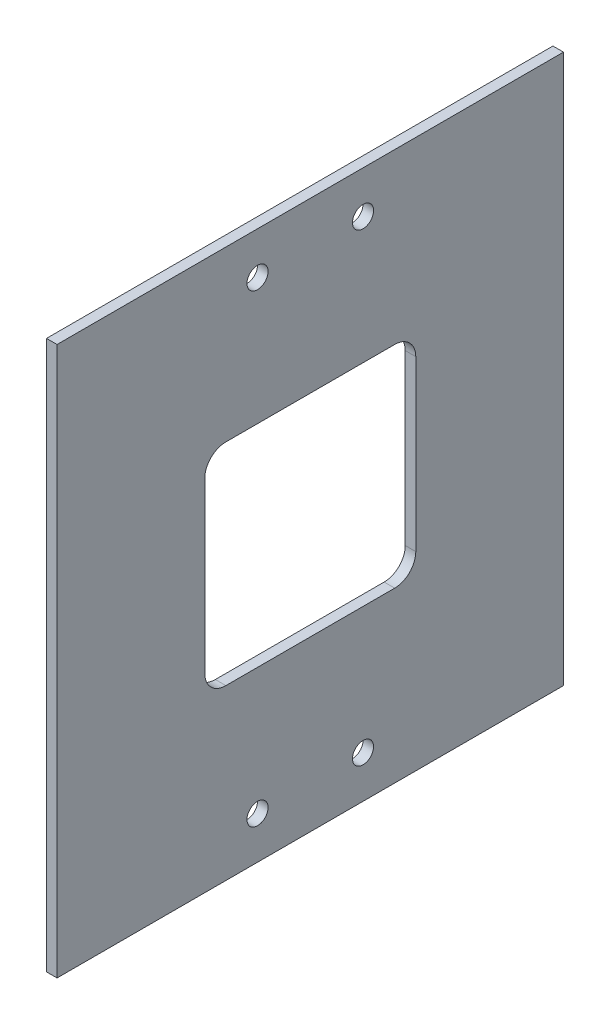
ISO-10303-21;
HEADER;
FILE_DESCRIPTION(('STEP AP214'),'2;1');
FILE_NAME('part.step','',(''),(''),'','','');
FILE_SCHEMA(('AUTOMOTIVE_DESIGN { 1 0 10303 214 1 1 1 1 }'));
ENDSEC;
DATA;
#1=APPLICATION_CONTEXT('core data for automotive mechanical design processes');
#2=APPLICATION_PROTOCOL_DEFINITION('international standard','automotive_design',2000,#1);
#3=PRODUCT_CONTEXT('',#1,'mechanical');
#4=PRODUCT('Part','Part','',(#3));
#5=PRODUCT_RELATED_PRODUCT_CATEGORY('part','',(#4));
#6=PRODUCT_DEFINITION_FORMATION('','',#4);
#7=PRODUCT_DEFINITION_CONTEXT('part definition',#1,'design');
#8=PRODUCT_DEFINITION('design','',#6,#7);
#9=PRODUCT_DEFINITION_SHAPE('','',#8);
#10=(LENGTH_UNIT() NAMED_UNIT(*) SI_UNIT(.MILLI.,.METRE.));
#11=(NAMED_UNIT(*) PLANE_ANGLE_UNIT() SI_UNIT($,.RADIAN.));
#12=(NAMED_UNIT(*) SI_UNIT($,.STERADIAN.) SOLID_ANGLE_UNIT());
#13=UNCERTAINTY_MEASURE_WITH_UNIT(LENGTH_MEASURE(1.E-05),#10,'distance_accuracy_value','');
#14=(GEOMETRIC_REPRESENTATION_CONTEXT(3) GLOBAL_UNCERTAINTY_ASSIGNED_CONTEXT((#13)) GLOBAL_UNIT_ASSIGNED_CONTEXT((#10,
#11,#12)) REPRESENTATION_CONTEXT('',''));
#15=CARTESIAN_POINT('',(0.,0.,0.));
#16=DIRECTION('',(0.,0.,1.));
#17=DIRECTION('',(1.,0.,0.));
#18=AXIS2_PLACEMENT_3D('',#15,#16,#17);
#19=CARTESIAN_POINT('',(3.175,82.55,0.));
#20=DIRECTION('',(0.,0.,-1.));
#21=DIRECTION('',(0.,1.,0.));
#22=AXIS2_PLACEMENT_3D('',#19,#20,#21);
#23=PLANE('',#22);
#24=DIRECTION('',(0.,-1.,0.));
#25=VECTOR('',#24,1.);
#26=CARTESIAN_POINT('',(0.,82.55,0.));
#27=LINE('',#26,#25);
#28=CARTESIAN_POINT('',(0.,82.55,0.));
#29=VERTEX_POINT('',#28);
#30=CARTESIAN_POINT('',(0.,-82.55,0.));
#31=VERTEX_POINT('',#30);
#32=EDGE_CURVE('E200',#29,#31,#27,.T.);
#33=ORIENTED_EDGE('',*,*,#32,.T.);
#34=DIRECTION('',(-1.,0.,0.));
#35=VECTOR('',#34,1.);
#36=CARTESIAN_POINT('',(3.175,-82.55,0.));
#37=LINE('',#36,#35);
#38=CARTESIAN_POINT('',(3.175,-82.55,0.));
#39=VERTEX_POINT('',#38);
#40=EDGE_CURVE('E11',#39,#31,#37,.T.);
#41=ORIENTED_EDGE('',*,*,#40,.F.);
#42=DIRECTION('',(0.,-1.,0.));
#43=VECTOR('',#42,1.);
#44=CARTESIAN_POINT('',(3.175,82.55,0.));
#45=LINE('',#44,#43);
#46=CARTESIAN_POINT('',(3.175,82.55,0.));
#47=VERTEX_POINT('',#46);
#48=EDGE_CURVE('E215',#47,#39,#45,.T.);
#49=ORIENTED_EDGE('',*,*,#48,.F.);
#50=DIRECTION('',(-1.,0.,0.));
#51=VECTOR('',#50,1.);
#52=CARTESIAN_POINT('',(3.175,82.55,0.));
#53=LINE('',#52,#51);
#54=EDGE_CURVE('E227',#47,#29,#53,.T.);
#55=ORIENTED_EDGE('',*,*,#54,.T.);
#56=EDGE_LOOP('',(#33,#41,#49,#55));
#57=FACE_BOUND('',#56,.T.);
#58=ADVANCED_FACE('F37',(#57),#23,.F.);
#59=CARTESIAN_POINT('',(3.175,-82.55,-152.4));
#60=DIRECTION('',(0.,1.,0.));
#61=DIRECTION('',(0.,0.,1.));
#62=AXIS2_PLACEMENT_3D('',#59,#60,#61);
#63=PLANE('',#62);
#64=DIRECTION('',(0.,0.,-1.));
#65=VECTOR('',#64,1.);
#66=CARTESIAN_POINT('',(0.,-82.55,-152.4));
#67=LINE('',#66,#65);
#68=CARTESIAN_POINT('',(0.,-82.55,-152.4));
#69=VERTEX_POINT('',#68);
#70=EDGE_CURVE('E230',#31,#69,#67,.T.);
#71=ORIENTED_EDGE('',*,*,#70,.T.);
#72=DIRECTION('',(-1.,0.,0.));
#73=VECTOR('',#72,1.);
#74=CARTESIAN_POINT('',(3.175,-82.55,-152.4));
#75=LINE('',#74,#73);
#76=CARTESIAN_POINT('',(3.175,-82.55,-152.4));
#77=VERTEX_POINT('',#76);
#78=EDGE_CURVE('E44',#77,#69,#75,.T.);
#79=ORIENTED_EDGE('',*,*,#78,.F.);
#80=DIRECTION('',(0.,0.,-1.));
#81=VECTOR('',#80,1.);
#82=CARTESIAN_POINT('',(3.175,-82.55,-152.4));
#83=LINE('',#82,#81);
#84=EDGE_CURVE('E218',#39,#77,#83,.T.);
#85=ORIENTED_EDGE('',*,*,#84,.F.);
#86=ORIENTED_EDGE('',*,*,#40,.T.);
#87=EDGE_LOOP('',(#71,#79,#85,#86));
#88=FACE_BOUND('',#87,.T.);
#89=ADVANCED_FACE('F260',(#88),#63,.F.);
#90=CARTESIAN_POINT('',(3.175,82.55,-152.4));
#91=DIRECTION('',(0.,0.,1.));
#92=DIRECTION('',(0.,-1.,0.));
#93=AXIS2_PLACEMENT_3D('',#90,#91,#92);
#94=PLANE('',#93);
#95=DIRECTION('',(0.,1.,0.));
#96=VECTOR('',#95,1.);
#97=CARTESIAN_POINT('',(0.,82.55,-152.4));
#98=LINE('',#97,#96);
#99=CARTESIAN_POINT('',(0.,82.55,-152.4));
#100=VERTEX_POINT('',#99);
#101=EDGE_CURVE('E233',#69,#100,#98,.T.);
#102=ORIENTED_EDGE('',*,*,#101,.T.);
#103=DIRECTION('',(-1.,0.,0.));
#104=VECTOR('',#103,1.);
#105=CARTESIAN_POINT('',(3.175,82.55,-152.4));
#106=LINE('',#105,#104);
#107=CARTESIAN_POINT('',(3.175,82.55,-152.4));
#108=VERTEX_POINT('',#107);
#109=EDGE_CURVE('E239',#108,#100,#106,.T.);
#110=ORIENTED_EDGE('',*,*,#109,.F.);
#111=DIRECTION('',(0.,1.,0.));
#112=VECTOR('',#111,1.);
#113=CARTESIAN_POINT('',(3.175,82.55,-152.4));
#114=LINE('',#113,#112);
#115=EDGE_CURVE('E222',#77,#108,#114,.T.);
#116=ORIENTED_EDGE('',*,*,#115,.F.);
#117=ORIENTED_EDGE('',*,*,#78,.T.);
#118=EDGE_LOOP('',(#102,#110,#116,#117));
#119=FACE_BOUND('',#118,.T.);
#120=ADVANCED_FACE('F246',(#119),#94,.F.);
#121=CARTESIAN_POINT('',(3.175,82.55,-152.4));
#122=DIRECTION('',(0.,-1.,0.));
#123=DIRECTION('',(0.,0.,-1.));
#124=AXIS2_PLACEMENT_3D('',#121,#122,#123);
#125=PLANE('',#124);
#126=DIRECTION('',(0.,0.,1.));
#127=VECTOR('',#126,1.);
#128=CARTESIAN_POINT('',(0.,82.55,-152.4));
#129=LINE('',#128,#127);
#130=EDGE_CURVE('E219',#100,#29,#129,.T.);
#131=ORIENTED_EDGE('',*,*,#130,.T.);
#132=ORIENTED_EDGE('',*,*,#54,.F.);
#133=DIRECTION('',(0.,0.,1.));
#134=VECTOR('',#133,1.);
#135=CARTESIAN_POINT('',(3.175,82.55,-152.4));
#136=LINE('',#135,#134);
#137=EDGE_CURVE('E225',#108,#47,#136,.T.);
#138=ORIENTED_EDGE('',*,*,#137,.F.);
#139=ORIENTED_EDGE('',*,*,#109,.T.);
#140=EDGE_LOOP('',(#131,#132,#138,#139));
#141=FACE_BOUND('',#140,.T.);
#142=ADVANCED_FACE('F255',(#141),#125,.F.);
#143=CARTESIAN_POINT('',(3.175,-82.55,0.));
#144=DIRECTION('',(-1.,0.,0.));
#145=DIRECTION('',(0.,0.,1.));
#146=AXIS2_PLACEMENT_3D('',#143,#144,#145);
#147=PLANE('',#146);
#148=CARTESIAN_POINT('',(3.175,-69.85,-60.325));
#149=DIRECTION('',(-1.,0.,0.));
#150=DIRECTION('',(0.,0.,1.));
#151=AXIS2_PLACEMENT_3D('',#148,#149,#150);
#152=CIRCLE('',#151,3.175);
#153=CARTESIAN_POINT('',(3.175,-69.85,-57.15));
#154=VERTEX_POINT('',#153);
#155=EDGE_CURVE('E323',#154,#154,#152,.T.);
#156=ORIENTED_EDGE('',*,*,#155,.T.);
#157=EDGE_LOOP('',(#156));
#158=FACE_BOUND('',#157,.T.);
#159=CARTESIAN_POINT('',(3.175,-69.85,-92.075));
#160=DIRECTION('',(-1.,0.,0.));
#161=DIRECTION('',(0.,0.,1.));
#162=AXIS2_PLACEMENT_3D('',#159,#160,#161);
#163=CIRCLE('',#162,3.175);
#164=CARTESIAN_POINT('',(3.175,-69.85,-88.9));
#165=VERTEX_POINT('',#164);
#166=EDGE_CURVE('E331',#165,#165,#163,.T.);
#167=ORIENTED_EDGE('',*,*,#166,.T.);
#168=EDGE_LOOP('',(#167));
#169=FACE_BOUND('',#168,.T.);
#170=CARTESIAN_POINT('',(3.175,69.85,-92.075));
#171=DIRECTION('',(-1.,0.,0.));
#172=DIRECTION('',(0.,0.,1.));
#173=AXIS2_PLACEMENT_3D('',#170,#171,#172);
#174=CIRCLE('',#173,3.175);
#175=CARTESIAN_POINT('',(3.175,69.85,-88.9));
#176=VERTEX_POINT('',#175);
#177=EDGE_CURVE('E339',#176,#176,#174,.T.);
#178=ORIENTED_EDGE('',*,*,#177,.T.);
#179=EDGE_LOOP('',(#178));
#180=FACE_BOUND('',#179,.T.);
#181=CARTESIAN_POINT('',(3.175,69.85,-60.325));
#182=DIRECTION('',(-1.,0.,0.));
#183=DIRECTION('',(0.,0.,1.));
#184=AXIS2_PLACEMENT_3D('',#181,#182,#183);
#185=CIRCLE('',#184,3.175);
#186=CARTESIAN_POINT('',(3.175,69.85,-57.15));
#187=VERTEX_POINT('',#186);
#188=EDGE_CURVE('E178',#187,#187,#185,.T.);
#189=ORIENTED_EDGE('',*,*,#188,.T.);
#190=EDGE_LOOP('',(#189));
#191=FACE_BOUND('',#190,.T.);
#192=CARTESIAN_POINT('',(3.175,-25.4,-101.6));
#193=DIRECTION('',(-1.,0.,0.));
#194=DIRECTION('',(0.,0.,1.));
#195=AXIS2_PLACEMENT_3D('',#192,#193,#194);
#196=CIRCLE('',#195,6.35000000000001);
#197=CARTESIAN_POINT('',(3.175,-25.4,-107.95));
#198=VERTEX_POINT('',#197);
#199=CARTESIAN_POINT('',(3.175,-31.75,-101.6));
#200=VERTEX_POINT('',#199);
#201=EDGE_CURVE('E139',#198,#200,#196,.T.);
#202=ORIENTED_EDGE('',*,*,#201,.T.);
#203=DIRECTION('',(0.,0.,1.));
#204=VECTOR('',#203,1.);
#205=CARTESIAN_POINT('',(3.175,-31.75,-76.2));
#206=LINE('',#205,#204);
#207=CARTESIAN_POINT('',(3.175,-31.75,-50.8));
#208=VERTEX_POINT('',#207);
#209=EDGE_CURVE('E133',#200,#208,#206,.T.);
#210=ORIENTED_EDGE('',*,*,#209,.T.);
#211=CARTESIAN_POINT('',(3.175,-25.4,-50.8));
#212=DIRECTION('',(-1.,0.,0.));
#213=DIRECTION('',(0.,0.,1.));
#214=AXIS2_PLACEMENT_3D('',#211,#212,#213);
#215=CIRCLE('',#214,6.35000000000001);
#216=CARTESIAN_POINT('',(3.175,-25.4,-44.45));
#217=VERTEX_POINT('',#216);
#218=EDGE_CURVE('E142',#208,#217,#215,.T.);
#219=ORIENTED_EDGE('',*,*,#218,.T.);
#220=DIRECTION('',(0.,1.,0.));
#221=VECTOR('',#220,1.);
#222=CARTESIAN_POINT('',(3.175,-174.906065520897,-44.45));
#223=LINE('',#222,#221);
#224=CARTESIAN_POINT('',(3.175,25.4,-44.45));
#225=VERTEX_POINT('',#224);
#226=EDGE_CURVE('E51',#217,#225,#223,.T.);
#227=ORIENTED_EDGE('',*,*,#226,.T.);
#228=CARTESIAN_POINT('',(3.175,25.4,-50.8));
#229=DIRECTION('',(-1.,0.,0.));
#230=DIRECTION('',(0.,0.,1.));
#231=AXIS2_PLACEMENT_3D('',#228,#229,#230);
#232=CIRCLE('',#231,6.35000000000001);
#233=CARTESIAN_POINT('',(3.175,31.75,-50.8));
#234=VERTEX_POINT('',#233);
#235=EDGE_CURVE('E160',#225,#234,#232,.T.);
#236=ORIENTED_EDGE('',*,*,#235,.T.);
#237=DIRECTION('',(0.,0.,-1.));
#238=VECTOR('',#237,1.);
#239=CARTESIAN_POINT('',(3.175,31.75,-76.2));
#240=LINE('',#239,#238);
#241=CARTESIAN_POINT('',(3.175,31.75,-101.6));
#242=VERTEX_POINT('',#241);
#243=EDGE_CURVE('E164',#234,#242,#240,.T.);
#244=ORIENTED_EDGE('',*,*,#243,.T.);
#245=CARTESIAN_POINT('',(3.175,25.4,-101.6));
#246=DIRECTION('',(-1.,0.,0.));
#247=DIRECTION('',(0.,0.,1.));
#248=AXIS2_PLACEMENT_3D('',#245,#246,#247);
#249=CIRCLE('',#248,6.35000000000001);
#250=CARTESIAN_POINT('',(3.175,25.4,-107.95));
#251=VERTEX_POINT('',#250);
#252=EDGE_CURVE('E168',#242,#251,#249,.T.);
#253=ORIENTED_EDGE('',*,*,#252,.T.);
#254=DIRECTION('',(0.,-1.,0.));
#255=VECTOR('',#254,1.);
#256=CARTESIAN_POINT('',(3.175,-174.906065520897,-107.95));
#257=LINE('',#256,#255);
#258=EDGE_CURVE('E172',#251,#198,#257,.T.);
#259=ORIENTED_EDGE('',*,*,#258,.T.);
#260=EDGE_LOOP('',(#202,#210,#219,#227,#236,#244,#253,#259));
#261=FACE_BOUND('',#260,.T.);
#262=ORIENTED_EDGE('',*,*,#48,.T.);
#263=ORIENTED_EDGE('',*,*,#84,.T.);
#264=ORIENTED_EDGE('',*,*,#115,.T.);
#265=ORIENTED_EDGE('',*,*,#137,.T.);
#266=EDGE_LOOP('',(#262,#263,#264,#265));
#267=FACE_BOUND('',#266,.T.);
#268=ADVANCED_FACE('F146',(#158,#169,#180,#191,#261,#267),#147,.F.);
#269=CARTESIAN_POINT('',(0.,-82.55,0.));
#270=DIRECTION('',(-1.,0.,0.));
#271=DIRECTION('',(0.,0.,1.));
#272=AXIS2_PLACEMENT_3D('',#269,#270,#271);
#273=PLANE('',#272);
#274=CARTESIAN_POINT('',(0.,-69.85,-60.325));
#275=DIRECTION('',(-1.,0.,0.));
#276=DIRECTION('',(0.,0.,1.));
#277=AXIS2_PLACEMENT_3D('',#274,#275,#276);
#278=CIRCLE('',#277,3.175);
#279=CARTESIAN_POINT('',(0.,-69.85,-57.15));
#280=VERTEX_POINT('',#279);
#281=EDGE_CURVE('E326',#280,#280,#278,.T.);
#282=ORIENTED_EDGE('',*,*,#281,.F.);
#283=EDGE_LOOP('',(#282));
#284=FACE_BOUND('',#283,.T.);
#285=CARTESIAN_POINT('',(0.,-69.85,-92.075));
#286=DIRECTION('',(-1.,0.,0.));
#287=DIRECTION('',(0.,0.,1.));
#288=AXIS2_PLACEMENT_3D('',#285,#286,#287);
#289=CIRCLE('',#288,3.175);
#290=CARTESIAN_POINT('',(0.,-69.85,-88.9));
#291=VERTEX_POINT('',#290);
#292=EDGE_CURVE('E328',#291,#291,#289,.T.);
#293=ORIENTED_EDGE('',*,*,#292,.F.);
#294=EDGE_LOOP('',(#293));
#295=FACE_BOUND('',#294,.T.);
#296=CARTESIAN_POINT('',(0.,69.85,-92.075));
#297=DIRECTION('',(-1.,0.,0.));
#298=DIRECTION('',(0.,0.,1.));
#299=AXIS2_PLACEMENT_3D('',#296,#297,#298);
#300=CIRCLE('',#299,3.175);
#301=CARTESIAN_POINT('',(0.,69.85,-88.9));
#302=VERTEX_POINT('',#301);
#303=EDGE_CURVE('E335',#302,#302,#300,.T.);
#304=ORIENTED_EDGE('',*,*,#303,.F.);
#305=EDGE_LOOP('',(#304));
#306=FACE_BOUND('',#305,.T.);
#307=CARTESIAN_POINT('',(0.,69.85,-60.325));
#308=DIRECTION('',(-1.,0.,0.));
#309=DIRECTION('',(0.,0.,1.));
#310=AXIS2_PLACEMENT_3D('',#307,#308,#309);
#311=CIRCLE('',#310,3.175);
#312=CARTESIAN_POINT('',(0.,69.85,-57.15));
#313=VERTEX_POINT('',#312);
#314=EDGE_CURVE('E156',#313,#313,#311,.T.);
#315=ORIENTED_EDGE('',*,*,#314,.F.);
#316=EDGE_LOOP('',(#315));
#317=FACE_BOUND('',#316,.T.);
#318=DIRECTION('',(0.,0.,1.));
#319=VECTOR('',#318,1.);
#320=CARTESIAN_POINT('',(0.,-31.75,-76.2));
#321=LINE('',#320,#319);
#322=CARTESIAN_POINT('',(0.,-31.75,-101.6));
#323=VERTEX_POINT('',#322);
#324=CARTESIAN_POINT('',(0.,-31.75,-50.8));
#325=VERTEX_POINT('',#324);
#326=EDGE_CURVE('E59',#323,#325,#321,.T.);
#327=ORIENTED_EDGE('',*,*,#326,.F.);
#328=CARTESIAN_POINT('',(0.,-25.4,-101.6));
#329=DIRECTION('',(-1.,0.,0.));
#330=DIRECTION('',(0.,0.,1.));
#331=AXIS2_PLACEMENT_3D('',#328,#329,#330);
#332=CIRCLE('',#331,6.35000000000001);
#333=CARTESIAN_POINT('',(0.,-25.4,-107.95));
#334=VERTEX_POINT('',#333);
#335=EDGE_CURVE('E150',#334,#323,#332,.T.);
#336=ORIENTED_EDGE('',*,*,#335,.F.);
#337=DIRECTION('',(0.,-1.,0.));
#338=VECTOR('',#337,1.);
#339=CARTESIAN_POINT('',(0.,-174.906065520897,-107.95));
#340=LINE('',#339,#338);
#341=CARTESIAN_POINT('',(0.,25.4,-107.95));
#342=VERTEX_POINT('',#341);
#343=EDGE_CURVE('E153',#342,#334,#340,.T.);
#344=ORIENTED_EDGE('',*,*,#343,.F.);
#345=CARTESIAN_POINT('',(0.,25.4,-101.6));
#346=DIRECTION('',(-1.,0.,0.));
#347=DIRECTION('',(0.,0.,1.));
#348=AXIS2_PLACEMENT_3D('',#345,#346,#347);
#349=CIRCLE('',#348,6.35000000000001);
#350=CARTESIAN_POINT('',(0.,31.75,-101.6));
#351=VERTEX_POINT('',#350);
#352=EDGE_CURVE('E191',#351,#342,#349,.T.);
#353=ORIENTED_EDGE('',*,*,#352,.F.);
#354=DIRECTION('',(0.,0.,-1.));
#355=VECTOR('',#354,1.);
#356=CARTESIAN_POINT('',(0.,31.75,-76.2));
#357=LINE('',#356,#355);
#358=CARTESIAN_POINT('',(0.,31.75,-50.8));
#359=VERTEX_POINT('',#358);
#360=EDGE_CURVE('E187',#359,#351,#357,.T.);
#361=ORIENTED_EDGE('',*,*,#360,.F.);
#362=CARTESIAN_POINT('',(0.,25.4,-50.8));
#363=DIRECTION('',(-1.,0.,0.));
#364=DIRECTION('',(0.,0.,1.));
#365=AXIS2_PLACEMENT_3D('',#362,#363,#364);
#366=CIRCLE('',#365,6.35000000000001);
#367=CARTESIAN_POINT('',(0.,25.4,-44.45));
#368=VERTEX_POINT('',#367);
#369=EDGE_CURVE('E183',#368,#359,#366,.T.);
#370=ORIENTED_EDGE('',*,*,#369,.F.);
#371=DIRECTION('',(0.,1.,0.));
#372=VECTOR('',#371,1.);
#373=CARTESIAN_POINT('',(0.,-174.906065520897,-44.45));
#374=LINE('',#373,#372);
#375=CARTESIAN_POINT('',(0.,-25.4,-44.45));
#376=VERTEX_POINT('',#375);
#377=EDGE_CURVE('E180',#376,#368,#374,.T.);
#378=ORIENTED_EDGE('',*,*,#377,.F.);
#379=CARTESIAN_POINT('',(0.,-25.4,-50.8));
#380=DIRECTION('',(-1.,0.,0.));
#381=DIRECTION('',(0.,0.,1.));
#382=AXIS2_PLACEMENT_3D('',#379,#380,#381);
#383=CIRCLE('',#382,6.35000000000001);
#384=EDGE_CURVE('E177',#325,#376,#383,.T.);
#385=ORIENTED_EDGE('',*,*,#384,.F.);
#386=EDGE_LOOP('',(#327,#336,#344,#353,#361,#370,#378,#385));
#387=FACE_BOUND('',#386,.T.);
#388=ORIENTED_EDGE('',*,*,#32,.F.);
#389=ORIENTED_EDGE('',*,*,#130,.F.);
#390=ORIENTED_EDGE('',*,*,#101,.F.);
#391=ORIENTED_EDGE('',*,*,#70,.F.);
#392=EDGE_LOOP('',(#388,#389,#390,#391));
#393=FACE_BOUND('',#392,.T.);
#394=ADVANCED_FACE('F252',(#284,#295,#306,#317,#387,#393),#273,.T.);
#395=CARTESIAN_POINT('',(3.175,-31.75,-76.2));
#396=DIRECTION('',(0.,-1.,0.));
#397=DIRECTION('',(0.,0.,-1.));
#398=AXIS2_PLACEMENT_3D('',#395,#396,#397);
#399=PLANE('',#398);
#400=ORIENTED_EDGE('',*,*,#326,.T.);
#401=DIRECTION('',(-1.,0.,0.));
#402=VECTOR('',#401,1.);
#403=CARTESIAN_POINT('',(3.175,-31.75,-50.8));
#404=LINE('',#403,#402);
#405=EDGE_CURVE('E129',#208,#325,#404,.T.);
#406=ORIENTED_EDGE('',*,*,#405,.F.);
#407=ORIENTED_EDGE('',*,*,#209,.F.);
#408=DIRECTION('',(-1.,0.,0.));
#409=VECTOR('',#408,1.);
#410=CARTESIAN_POINT('',(3.175,-31.75,-101.6));
#411=LINE('',#410,#409);
#412=EDGE_CURVE('E198',#200,#323,#411,.T.);
#413=ORIENTED_EDGE('',*,*,#412,.T.);
#414=EDGE_LOOP('',(#400,#406,#407,#413));
#415=FACE_BOUND('',#414,.T.);
#416=ADVANCED_FACE('F131',(#415),#399,.F.);
#417=CARTESIAN_POINT('',(3.175,-25.4,-101.6));
#418=DIRECTION('',(-1.,0.,0.));
#419=DIRECTION('',(0.,0.,1.));
#420=AXIS2_PLACEMENT_3D('',#417,#418,#419);
#421=CYLINDRICAL_SURFACE('',#420,6.35000000000001);
#422=ORIENTED_EDGE('',*,*,#335,.T.);
#423=ORIENTED_EDGE('',*,*,#412,.F.);
#424=ORIENTED_EDGE('',*,*,#201,.F.);
#425=DIRECTION('',(-1.,0.,0.));
#426=VECTOR('',#425,1.);
#427=CARTESIAN_POINT('',(3.175,-25.4,-107.95));
#428=LINE('',#427,#426);
#429=EDGE_CURVE('E201',#198,#334,#428,.T.);
#430=ORIENTED_EDGE('',*,*,#429,.T.);
#431=EDGE_LOOP('',(#422,#423,#424,#430));
#432=FACE_BOUND('',#431,.T.);
#433=ADVANCED_FACE('F278',(#432),#421,.F.);
#434=CARTESIAN_POINT('',(3.175,-174.906065520897,-107.95));
#435=DIRECTION('',(0.,0.,-1.));
#436=DIRECTION('',(-1.,0.,0.));
#437=AXIS2_PLACEMENT_3D('',#434,#435,#436);
#438=PLANE('',#437);
#439=ORIENTED_EDGE('',*,*,#343,.T.);
#440=ORIENTED_EDGE('',*,*,#429,.F.);
#441=ORIENTED_EDGE('',*,*,#258,.F.);
#442=DIRECTION('',(-1.,0.,0.));
#443=VECTOR('',#442,1.);
#444=CARTESIAN_POINT('',(3.175,25.4,-107.95));
#445=LINE('',#444,#443);
#446=EDGE_CURVE('E203',#251,#342,#445,.T.);
#447=ORIENTED_EDGE('',*,*,#446,.T.);
#448=EDGE_LOOP('',(#439,#440,#441,#447));
#449=FACE_BOUND('',#448,.T.);
#450=ADVANCED_FACE('F296',(#449),#438,.F.);
#451=CARTESIAN_POINT('',(3.175,25.4,-101.6));
#452=DIRECTION('',(-1.,0.,0.));
#453=DIRECTION('',(0.,0.,1.));
#454=AXIS2_PLACEMENT_3D('',#451,#452,#453);
#455=CYLINDRICAL_SURFACE('',#454,6.35000000000001);
#456=ORIENTED_EDGE('',*,*,#352,.T.);
#457=ORIENTED_EDGE('',*,*,#446,.F.);
#458=ORIENTED_EDGE('',*,*,#252,.F.);
#459=DIRECTION('',(-1.,0.,0.));
#460=VECTOR('',#459,1.);
#461=CARTESIAN_POINT('',(3.175,31.75,-101.6));
#462=LINE('',#461,#460);
#463=EDGE_CURVE('E206',#242,#351,#462,.T.);
#464=ORIENTED_EDGE('',*,*,#463,.T.);
#465=EDGE_LOOP('',(#456,#457,#458,#464));
#466=FACE_BOUND('',#465,.T.);
#467=ADVANCED_FACE('F292',(#466),#455,.F.);
#468=CARTESIAN_POINT('',(3.175,31.75,-76.2));
#469=DIRECTION('',(0.,1.,0.));
#470=DIRECTION('',(0.,0.,1.));
#471=AXIS2_PLACEMENT_3D('',#468,#469,#470);
#472=PLANE('',#471);
#473=ORIENTED_EDGE('',*,*,#360,.T.);
#474=ORIENTED_EDGE('',*,*,#463,.F.);
#475=ORIENTED_EDGE('',*,*,#243,.F.);
#476=DIRECTION('',(-1.,0.,0.));
#477=VECTOR('',#476,1.);
#478=CARTESIAN_POINT('',(3.175,31.75,-50.8));
#479=LINE('',#478,#477);
#480=EDGE_CURVE('E209',#234,#359,#479,.T.);
#481=ORIENTED_EDGE('',*,*,#480,.T.);
#482=EDGE_LOOP('',(#473,#474,#475,#481));
#483=FACE_BOUND('',#482,.T.);
#484=ADVANCED_FACE('F288',(#483),#472,.F.);
#485=CARTESIAN_POINT('',(3.175,25.4,-50.8));
#486=DIRECTION('',(-1.,0.,0.));
#487=DIRECTION('',(0.,0.,1.));
#488=AXIS2_PLACEMENT_3D('',#485,#486,#487);
#489=CYLINDRICAL_SURFACE('',#488,6.35000000000001);
#490=ORIENTED_EDGE('',*,*,#369,.T.);
#491=ORIENTED_EDGE('',*,*,#480,.F.);
#492=ORIENTED_EDGE('',*,*,#235,.F.);
#493=DIRECTION('',(-1.,0.,0.));
#494=VECTOR('',#493,1.);
#495=CARTESIAN_POINT('',(3.175,25.4,-44.45));
#496=LINE('',#495,#494);
#497=EDGE_CURVE('E212',#225,#368,#496,.T.);
#498=ORIENTED_EDGE('',*,*,#497,.T.);
#499=EDGE_LOOP('',(#490,#491,#492,#498));
#500=FACE_BOUND('',#499,.T.);
#501=ADVANCED_FACE('F285',(#500),#489,.F.);
#502=CARTESIAN_POINT('',(3.175,-174.906065520897,-44.45));
#503=DIRECTION('',(0.,0.,1.));
#504=DIRECTION('',(0.,-1.,0.));
#505=AXIS2_PLACEMENT_3D('',#502,#503,#504);
#506=PLANE('',#505);
#507=ORIENTED_EDGE('',*,*,#377,.T.);
#508=ORIENTED_EDGE('',*,*,#497,.F.);
#509=ORIENTED_EDGE('',*,*,#226,.F.);
#510=DIRECTION('',(-1.,0.,0.));
#511=VECTOR('',#510,1.);
#512=CARTESIAN_POINT('',(3.175,-25.4,-44.45));
#513=LINE('',#512,#511);
#514=EDGE_CURVE('E138',#217,#376,#513,.T.);
#515=ORIENTED_EDGE('',*,*,#514,.T.);
#516=EDGE_LOOP('',(#507,#508,#509,#515));
#517=FACE_BOUND('',#516,.T.);
#518=ADVANCED_FACE('F282',(#517),#506,.F.);
#519=CARTESIAN_POINT('',(3.175,-25.4,-50.8));
#520=DIRECTION('',(-1.,0.,0.));
#521=DIRECTION('',(0.,0.,1.));
#522=AXIS2_PLACEMENT_3D('',#519,#520,#521);
#523=CYLINDRICAL_SURFACE('',#522,6.35000000000001);
#524=ORIENTED_EDGE('',*,*,#384,.T.);
#525=ORIENTED_EDGE('',*,*,#514,.F.);
#526=ORIENTED_EDGE('',*,*,#218,.F.);
#527=ORIENTED_EDGE('',*,*,#405,.T.);
#528=EDGE_LOOP('',(#524,#525,#526,#527));
#529=FACE_BOUND('',#528,.T.);
#530=ADVANCED_FACE('F143',(#529),#523,.F.);
#531=CARTESIAN_POINT('',(3.175,69.85,-60.325));
#532=DIRECTION('',(-1.,0.,0.));
#533=DIRECTION('',(0.,0.,1.));
#534=AXIS2_PLACEMENT_3D('',#531,#532,#533);
#535=CYLINDRICAL_SURFACE('',#534,3.175);
#536=ORIENTED_EDGE('',*,*,#188,.F.);
#537=EDGE_LOOP('',(#536));
#538=FACE_BOUND('',#537,.T.);
#539=ORIENTED_EDGE('',*,*,#314,.T.);
#540=EDGE_LOOP('',(#539));
#541=FACE_BOUND('',#540,.T.);
#542=ADVANCED_FACE('F281',(#538,#541),#535,.F.);
#543=CARTESIAN_POINT('',(3.175,69.85,-92.075));
#544=DIRECTION('',(-1.,0.,0.));
#545=DIRECTION('',(0.,0.,1.));
#546=AXIS2_PLACEMENT_3D('',#543,#544,#545);
#547=CYLINDRICAL_SURFACE('',#546,3.175);
#548=ORIENTED_EDGE('',*,*,#177,.F.);
#549=EDGE_LOOP('',(#548));
#550=FACE_BOUND('',#549,.T.);
#551=ORIENTED_EDGE('',*,*,#303,.T.);
#552=EDGE_LOOP('',(#551));
#553=FACE_BOUND('',#552,.T.);
#554=ADVANCED_FACE('F306',(#550,#553),#547,.F.);
#555=CARTESIAN_POINT('',(3.175,-69.85,-92.075));
#556=DIRECTION('',(-1.,0.,0.));
#557=DIRECTION('',(0.,0.,1.));
#558=AXIS2_PLACEMENT_3D('',#555,#556,#557);
#559=CYLINDRICAL_SURFACE('',#558,3.175);
#560=ORIENTED_EDGE('',*,*,#166,.F.);
#561=EDGE_LOOP('',(#560));
#562=FACE_BOUND('',#561,.T.);
#563=ORIENTED_EDGE('',*,*,#292,.T.);
#564=EDGE_LOOP('',(#563));
#565=FACE_BOUND('',#564,.T.);
#566=ADVANCED_FACE('F310',(#562,#565),#559,.F.);
#567=CARTESIAN_POINT('',(3.175,-69.85,-60.325));
#568=DIRECTION('',(-1.,0.,0.));
#569=DIRECTION('',(0.,0.,1.));
#570=AXIS2_PLACEMENT_3D('',#567,#568,#569);
#571=CYLINDRICAL_SURFACE('',#570,3.175);
#572=ORIENTED_EDGE('',*,*,#155,.F.);
#573=EDGE_LOOP('',(#572));
#574=FACE_BOUND('',#573,.T.);
#575=ORIENTED_EDGE('',*,*,#281,.T.);
#576=EDGE_LOOP('',(#575));
#577=FACE_BOUND('',#576,.T.);
#578=ADVANCED_FACE('F314',(#574,#577),#571,.F.);
#579=CLOSED_SHELL('',(#58,#89,#120,#142,#268,#394,#416,#433,#450,#467,#484,#501,#518,#530,#542,
#554,#566,#578));
#580=MANIFOLD_SOLID_BREP('B2',#579);
#581=ADVANCED_BREP_SHAPE_REPRESENTATION('',(#18,#580),#14);
#582=SHAPE_DEFINITION_REPRESENTATION(#9,#581);
ENDSEC;
END-ISO-10303-21;
